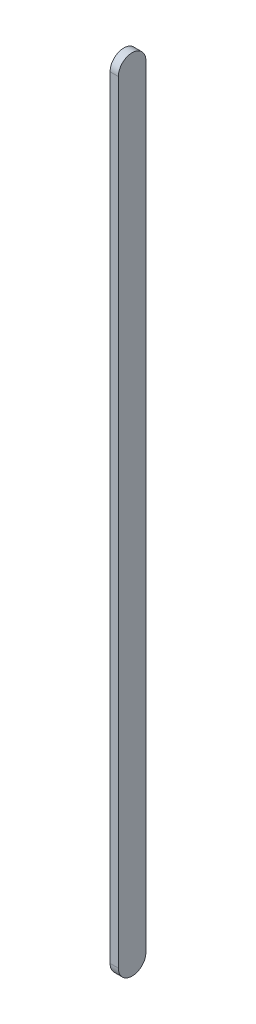
ISO-10303-21;
HEADER;
FILE_DESCRIPTION(('STEP AP214'),'2;1');
FILE_NAME('part.step','',(''),(''),'','','');
FILE_SCHEMA(('AUTOMOTIVE_DESIGN { 1 0 10303 214 1 1 1 1 }'));
ENDSEC;
DATA;
#1=APPLICATION_CONTEXT('core data for automotive mechanical design processes');
#2=APPLICATION_PROTOCOL_DEFINITION('international standard','automotive_design',2000,#1);
#3=PRODUCT_CONTEXT('',#1,'mechanical');
#4=PRODUCT('Part','Part','',(#3));
#5=PRODUCT_RELATED_PRODUCT_CATEGORY('part','',(#4));
#6=PRODUCT_DEFINITION_FORMATION('','',#4);
#7=PRODUCT_DEFINITION_CONTEXT('part definition',#1,'design');
#8=PRODUCT_DEFINITION('design','',#6,#7);
#9=PRODUCT_DEFINITION_SHAPE('','',#8);
#10=(LENGTH_UNIT() NAMED_UNIT(*) SI_UNIT(.MILLI.,.METRE.));
#11=(NAMED_UNIT(*) PLANE_ANGLE_UNIT() SI_UNIT($,.RADIAN.));
#12=(NAMED_UNIT(*) SI_UNIT($,.STERADIAN.) SOLID_ANGLE_UNIT());
#13=UNCERTAINTY_MEASURE_WITH_UNIT(LENGTH_MEASURE(1.E-05),#10,'distance_accuracy_value','');
#14=(GEOMETRIC_REPRESENTATION_CONTEXT(3) GLOBAL_UNCERTAINTY_ASSIGNED_CONTEXT((#13)) GLOBAL_UNIT_ASSIGNED_CONTEXT((#10,
#11,#12)) REPRESENTATION_CONTEXT('',''));
#15=CARTESIAN_POINT('',(0.,0.,0.));
#16=DIRECTION('',(0.,0.,1.));
#17=DIRECTION('',(1.,0.,0.));
#18=AXIS2_PLACEMENT_3D('',#15,#16,#17);
#19=CARTESIAN_POINT('',(3.,0.,0.));
#20=DIRECTION('',(-1.,0.,0.));
#21=DIRECTION('',(0.,0.,1.));
#22=AXIS2_PLACEMENT_3D('',#19,#20,#21);
#23=CYLINDRICAL_SURFACE('',#22,5.);
#24=CARTESIAN_POINT('',(0.,0.,0.));
#25=DIRECTION('',(1.,0.,0.));
#26=DIRECTION('',(0.,0.,-1.));
#27=AXIS2_PLACEMENT_3D('',#24,#25,#26);
#28=CIRCLE('',#27,5.);
#29=CARTESIAN_POINT('',(0.,0.,-5.));
#30=VERTEX_POINT('',#29);
#31=CARTESIAN_POINT('',(0.,0.,5.));
#32=VERTEX_POINT('',#31);
#33=EDGE_CURVE('E100',#30,#32,#28,.T.);
#34=ORIENTED_EDGE('',*,*,#33,.T.);
#35=DIRECTION('',(-1.,0.,0.));
#36=VECTOR('',#35,1.);
#37=CARTESIAN_POINT('',(3.,0.,5.));
#38=LINE('',#37,#36);
#39=CARTESIAN_POINT('',(3.,0.,5.));
#40=VERTEX_POINT('',#39);
#41=EDGE_CURVE('E11',#40,#32,#38,.T.);
#42=ORIENTED_EDGE('',*,*,#41,.F.);
#43=CARTESIAN_POINT('',(3.,0.,0.));
#44=DIRECTION('',(1.,0.,0.));
#45=DIRECTION('',(0.,0.,-1.));
#46=AXIS2_PLACEMENT_3D('',#43,#44,#45);
#47=CIRCLE('',#46,5.);
#48=CARTESIAN_POINT('',(3.,0.,-5.));
#49=VERTEX_POINT('',#48);
#50=EDGE_CURVE('E88',#49,#40,#47,.T.);
#51=ORIENTED_EDGE('',*,*,#50,.F.);
#52=DIRECTION('',(-1.,0.,0.));
#53=VECTOR('',#52,1.);
#54=CARTESIAN_POINT('',(3.,0.,-5.));
#55=LINE('',#54,#53);
#56=EDGE_CURVE('E96',#49,#30,#55,.T.);
#57=ORIENTED_EDGE('',*,*,#56,.T.);
#58=EDGE_LOOP('',(#34,#42,#51,#57));
#59=FACE_BOUND('',#58,.T.);
#60=ADVANCED_FACE('F37',(#59),#23,.T.);
#61=CARTESIAN_POINT('',(3.,0.,5.));
#62=DIRECTION('',(0.,0.,-1.));
#63=DIRECTION('',(0.,1.,0.));
#64=AXIS2_PLACEMENT_3D('',#61,#62,#63);
#65=PLANE('',#64);
#66=DIRECTION('',(0.,-1.,0.));
#67=VECTOR('',#66,1.);
#68=CARTESIAN_POINT('',(0.,0.,5.));
#69=LINE('',#68,#67);
#70=CARTESIAN_POINT('',(0.,-280.,5.));
#71=VERTEX_POINT('',#70);
#72=EDGE_CURVE('E92',#32,#71,#69,.T.);
#73=ORIENTED_EDGE('',*,*,#72,.T.);
#74=DIRECTION('',(-1.,0.,0.));
#75=VECTOR('',#74,1.);
#76=CARTESIAN_POINT('',(3.,-280.,5.));
#77=LINE('',#76,#75);
#78=CARTESIAN_POINT('',(3.,-280.,5.));
#79=VERTEX_POINT('',#78);
#80=EDGE_CURVE('E45',#79,#71,#77,.T.);
#81=ORIENTED_EDGE('',*,*,#80,.F.);
#82=DIRECTION('',(0.,-1.,0.));
#83=VECTOR('',#82,1.);
#84=CARTESIAN_POINT('',(3.,0.,5.));
#85=LINE('',#84,#83);
#86=EDGE_CURVE('E83',#40,#79,#85,.T.);
#87=ORIENTED_EDGE('',*,*,#86,.F.);
#88=ORIENTED_EDGE('',*,*,#41,.T.);
#89=EDGE_LOOP('',(#73,#81,#87,#88));
#90=FACE_BOUND('',#89,.T.);
#91=ADVANCED_FACE('F91',(#90),#65,.F.);
#92=CARTESIAN_POINT('',(3.,-280.,0.));
#93=DIRECTION('',(-1.,0.,0.));
#94=DIRECTION('',(0.,0.,1.));
#95=AXIS2_PLACEMENT_3D('',#92,#93,#94);
#96=CYLINDRICAL_SURFACE('',#95,5.);
#97=CARTESIAN_POINT('',(0.,-280.,0.));
#98=DIRECTION('',(1.,0.,0.));
#99=DIRECTION('',(0.,0.,-1.));
#100=AXIS2_PLACEMENT_3D('',#97,#98,#99);
#101=CIRCLE('',#100,5.);
#102=CARTESIAN_POINT('',(0.,-280.,-5.00000000000004));
#103=VERTEX_POINT('',#102);
#104=EDGE_CURVE('E70',#71,#103,#101,.T.);
#105=ORIENTED_EDGE('',*,*,#104,.T.);
#106=DIRECTION('',(-1.,0.,0.));
#107=VECTOR('',#106,1.);
#108=CARTESIAN_POINT('',(3.,-280.,-5.00000000000004));
#109=LINE('',#108,#107);
#110=CARTESIAN_POINT('',(3.,-280.,-5.00000000000004));
#111=VERTEX_POINT('',#110);
#112=EDGE_CURVE('E93',#111,#103,#109,.T.);
#113=ORIENTED_EDGE('',*,*,#112,.F.);
#114=CARTESIAN_POINT('',(3.,-280.,0.));
#115=DIRECTION('',(1.,0.,0.));
#116=DIRECTION('',(0.,0.,-1.));
#117=AXIS2_PLACEMENT_3D('',#114,#115,#116);
#118=CIRCLE('',#117,5.);
#119=EDGE_CURVE('E86',#79,#111,#118,.T.);
#120=ORIENTED_EDGE('',*,*,#119,.F.);
#121=ORIENTED_EDGE('',*,*,#80,.T.);
#122=EDGE_LOOP('',(#105,#113,#120,#121));
#123=FACE_BOUND('',#122,.T.);
#124=ADVANCED_FACE('F94',(#123),#96,.T.);
#125=CARTESIAN_POINT('',(3.,0.,-5.));
#126=DIRECTION('',(0.,0.,1.));
#127=DIRECTION('',(0.,-1.,0.));
#128=AXIS2_PLACEMENT_3D('',#125,#126,#127);
#129=PLANE('',#128);
#130=DIRECTION('',(0.,1.,0.));
#131=VECTOR('',#130,1.);
#132=CARTESIAN_POINT('',(0.,0.,-5.));
#133=LINE('',#132,#131);
#134=EDGE_CURVE('E76',#103,#30,#133,.T.);
#135=ORIENTED_EDGE('',*,*,#134,.T.);
#136=ORIENTED_EDGE('',*,*,#56,.F.);
#137=DIRECTION('',(0.,1.,0.));
#138=VECTOR('',#137,1.);
#139=CARTESIAN_POINT('',(3.,0.,-5.));
#140=LINE('',#139,#138);
#141=EDGE_CURVE('E53',#111,#49,#140,.T.);
#142=ORIENTED_EDGE('',*,*,#141,.F.);
#143=ORIENTED_EDGE('',*,*,#112,.T.);
#144=EDGE_LOOP('',(#135,#136,#142,#143));
#145=FACE_BOUND('',#144,.T.);
#146=ADVANCED_FACE('F107',(#145),#129,.F.);
#147=CARTESIAN_POINT('',(3.,0.,0.));
#148=DIRECTION('',(1.,0.,0.));
#149=DIRECTION('',(0.,0.,-1.));
#150=AXIS2_PLACEMENT_3D('',#147,#148,#149);
#151=PLANE('',#150);
#152=ORIENTED_EDGE('',*,*,#50,.T.);
#153=ORIENTED_EDGE('',*,*,#86,.T.);
#154=ORIENTED_EDGE('',*,*,#119,.T.);
#155=ORIENTED_EDGE('',*,*,#141,.T.);
#156=EDGE_LOOP('',(#152,#153,#154,#155));
#157=FACE_BOUND('',#156,.T.);
#158=ADVANCED_FACE('F84',(#157),#151,.T.);
#159=CARTESIAN_POINT('',(0.,0.,0.));
#160=DIRECTION('',(1.,0.,0.));
#161=DIRECTION('',(0.,0.,-1.));
#162=AXIS2_PLACEMENT_3D('',#159,#160,#161);
#163=PLANE('',#162);
#164=ORIENTED_EDGE('',*,*,#33,.F.);
#165=ORIENTED_EDGE('',*,*,#134,.F.);
#166=ORIENTED_EDGE('',*,*,#104,.F.);
#167=ORIENTED_EDGE('',*,*,#72,.F.);
#168=EDGE_LOOP('',(#164,#165,#166,#167));
#169=FACE_BOUND('',#168,.T.);
#170=ADVANCED_FACE('F110',(#169),#163,.F.);
#171=CLOSED_SHELL('',(#60,#91,#124,#146,#158,#170));
#172=MANIFOLD_SOLID_BREP('B2',#171);
#173=ADVANCED_BREP_SHAPE_REPRESENTATION('',(#18,#172),#14);
#174=SHAPE_DEFINITION_REPRESENTATION(#9,#173);
ENDSEC;
END-ISO-10303-21;
